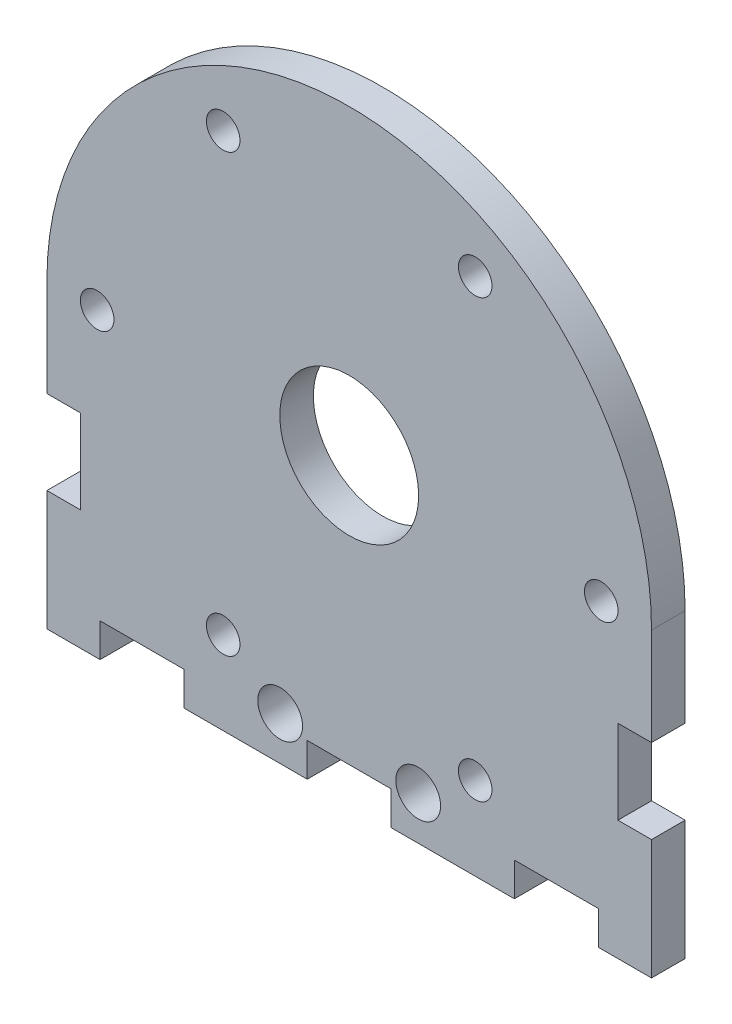
ISO-10303-21;
HEADER;
FILE_DESCRIPTION(('STEP AP214'),'2;1');
FILE_NAME('part.step','',(''),(''),'','','');
FILE_SCHEMA(('AUTOMOTIVE_DESIGN { 1 0 10303 214 1 1 1 1 }'));
ENDSEC;
DATA;
#1=APPLICATION_CONTEXT('core data for automotive mechanical design processes');
#2=APPLICATION_PROTOCOL_DEFINITION('international standard','automotive_design',2000,#1);
#3=PRODUCT_CONTEXT('',#1,'mechanical');
#4=PRODUCT('Part','Part','',(#3));
#5=PRODUCT_RELATED_PRODUCT_CATEGORY('part','',(#4));
#6=PRODUCT_DEFINITION_FORMATION('','',#4);
#7=PRODUCT_DEFINITION_CONTEXT('part definition',#1,'design');
#8=PRODUCT_DEFINITION('design','',#6,#7);
#9=PRODUCT_DEFINITION_SHAPE('','',#8);
#10=(LENGTH_UNIT() NAMED_UNIT(*) SI_UNIT(.MILLI.,.METRE.));
#11=(NAMED_UNIT(*) PLANE_ANGLE_UNIT() SI_UNIT($,.RADIAN.));
#12=(NAMED_UNIT(*) SI_UNIT($,.STERADIAN.) SOLID_ANGLE_UNIT());
#13=UNCERTAINTY_MEASURE_WITH_UNIT(LENGTH_MEASURE(1.E-05),#10,'distance_accuracy_value','');
#14=(GEOMETRIC_REPRESENTATION_CONTEXT(3) GLOBAL_UNCERTAINTY_ASSIGNED_CONTEXT((#13)) GLOBAL_UNIT_ASSIGNED_CONTEXT((#10,
#11,#12)) REPRESENTATION_CONTEXT('',''));
#15=CARTESIAN_POINT('',(0.,0.,0.));
#16=DIRECTION('',(0.,0.,1.));
#17=DIRECTION('',(1.,0.,0.));
#18=AXIS2_PLACEMENT_3D('',#15,#16,#17);
#19=CARTESIAN_POINT('',(2522.17425185726,0.,3.));
#20=DIRECTION('',(1.,0.,0.));
#21=DIRECTION('',(0.,0.,-1.));
#22=AXIS2_PLACEMENT_3D('',#19,#20,#21);
#23=PLANE('',#22);
#24=DIRECTION('',(0.,-1.,0.));
#25=VECTOR('',#24,1.);
#26=CARTESIAN_POINT('',(2522.17425185726,0.,0.));
#27=LINE('',#26,#25);
#28=CARTESIAN_POINT('',(2522.17425185726,1992.03397427987,0.));
#29=VERTEX_POINT('',#28);
#30=CARTESIAN_POINT('',(2522.17425185726,1983.32752149649,0.));
#31=VERTEX_POINT('',#30);
#32=EDGE_CURVE('E275',#29,#31,#27,.T.);
#33=ORIENTED_EDGE('',*,*,#32,.F.);
#34=DIRECTION('',(0.,0.,-1.));
#35=VECTOR('',#34,1.);
#36=CARTESIAN_POINT('',(2522.17425185726,1992.03397427987,3.));
#37=LINE('',#36,#35);
#38=CARTESIAN_POINT('',(2522.17425185726,1992.03397427987,3.));
#39=VERTEX_POINT('',#38);
#40=EDGE_CURVE('E11',#39,#29,#37,.T.);
#41=ORIENTED_EDGE('',*,*,#40,.F.);
#42=DIRECTION('',(0.,-1.,0.));
#43=VECTOR('',#42,1.);
#44=CARTESIAN_POINT('',(2522.17425185726,0.,3.));
#45=LINE('',#44,#43);
#46=CARTESIAN_POINT('',(2522.17425185726,1983.32752149649,3.));
#47=VERTEX_POINT('',#46);
#48=EDGE_CURVE('E986',#39,#47,#45,.T.);
#49=ORIENTED_EDGE('',*,*,#48,.T.);
#50=DIRECTION('',(0.,0.,-1.));
#51=VECTOR('',#50,1.);
#52=CARTESIAN_POINT('',(2522.17425185726,1983.32752149649,3.));
#53=LINE('',#52,#51);
#54=EDGE_CURVE('E61',#47,#31,#53,.T.);
#55=ORIENTED_EDGE('',*,*,#54,.T.);
#56=EDGE_LOOP('',(#33,#41,#49,#55));
#57=FACE_BOUND('',#56,.T.);
#58=ADVANCED_FACE('F43',(#57),#23,.T.);
#59=CARTESIAN_POINT('',(2495.17425185726,1992.03397427987,3.));
#60=DIRECTION('',(0.,0.,-1.));
#61=DIRECTION('',(-1.,0.,0.));
#62=AXIS2_PLACEMENT_3D('',#59,#60,#61);
#63=CYLINDRICAL_SURFACE('',#62,27.0000000000004);
#64=CARTESIAN_POINT('',(2495.17425185726,1992.03397427987,0.));
#65=DIRECTION('',(0.,0.,1.));
#66=DIRECTION('',(1.,0.,0.));
#67=AXIS2_PLACEMENT_3D('',#64,#65,#66);
#68=CIRCLE('',#67,27.0000000000004);
#69=CARTESIAN_POINT('',(2468.17425185726,1992.03397427987,0.));
#70=VERTEX_POINT('',#69);
#71=EDGE_CURVE('E278',#29,#70,#68,.T.);
#72=ORIENTED_EDGE('',*,*,#71,.T.);
#73=DIRECTION('',(0.,0.,-1.));
#74=VECTOR('',#73,1.);
#75=CARTESIAN_POINT('',(2468.17425185726,1992.03397427987,3.));
#76=LINE('',#75,#74);
#77=CARTESIAN_POINT('',(2468.17425185726,1992.03397427987,3.));
#78=VERTEX_POINT('',#77);
#79=EDGE_CURVE('E53',#78,#70,#76,.T.);
#80=ORIENTED_EDGE('',*,*,#79,.F.);
#81=CARTESIAN_POINT('',(2495.17425185726,1992.03397427987,3.));
#82=DIRECTION('',(0.,0.,1.));
#83=DIRECTION('',(1.,0.,0.));
#84=AXIS2_PLACEMENT_3D('',#81,#82,#83);
#85=CIRCLE('',#84,27.0000000000004);
#86=EDGE_CURVE('E901',#39,#78,#85,.T.);
#87=ORIENTED_EDGE('',*,*,#86,.F.);
#88=ORIENTED_EDGE('',*,*,#40,.T.);
#89=EDGE_LOOP('',(#72,#80,#87,#88));
#90=FACE_BOUND('',#89,.T.);
#91=ADVANCED_FACE('F448',(#90),#63,.T.);
#92=CARTESIAN_POINT('',(2468.17425185746,2.51787859086005E-10,3.));
#93=DIRECTION('',(1.,1.02013809963587E-13,0.));
#94=DIRECTION('',(-1.02013809963587E-13,1.,0.));
#95=AXIS2_PLACEMENT_3D('',#92,#93,#94);
#96=PLANE('',#95);
#97=DIRECTION('',(1.02013809963587E-13,-1.,0.));
#98=VECTOR('',#97,1.);
#99=CARTESIAN_POINT('',(2468.17425185746,2.51787859086005E-10,0.));
#100=LINE('',#99,#98);
#101=CARTESIAN_POINT('',(2468.17425185726,1983.32752149649,0.));
#102=VERTEX_POINT('',#101);
#103=EDGE_CURVE('E282',#70,#102,#100,.T.);
#104=ORIENTED_EDGE('',*,*,#103,.T.);
#105=DIRECTION('',(0.,0.,-1.));
#106=VECTOR('',#105,1.);
#107=CARTESIAN_POINT('',(2468.17425185726,1983.32752149649,3.));
#108=LINE('',#107,#106);
#109=CARTESIAN_POINT('',(2468.17425185726,1983.32752149649,3.));
#110=VERTEX_POINT('',#109);
#111=EDGE_CURVE('E434',#110,#102,#108,.T.);
#112=ORIENTED_EDGE('',*,*,#111,.F.);
#113=DIRECTION('',(1.02013809963587E-13,-1.,0.));
#114=VECTOR('',#113,1.);
#115=CARTESIAN_POINT('',(2468.17425185746,2.51787859086005E-10,3.));
#116=LINE('',#115,#114);
#117=EDGE_CURVE('E444',#78,#110,#116,.T.);
#118=ORIENTED_EDGE('',*,*,#117,.F.);
#119=ORIENTED_EDGE('',*,*,#79,.T.);
#120=EDGE_LOOP('',(#104,#112,#118,#119));
#121=FACE_BOUND('',#120,.T.);
#122=ADVANCED_FACE('F441',(#121),#96,.F.);
#123=CARTESIAN_POINT('',(0.,1983.32752149649,3.));
#124=DIRECTION('',(0.,1.,0.));
#125=DIRECTION('',(0.,0.,1.));
#126=AXIS2_PLACEMENT_3D('',#123,#124,#125);
#127=PLANE('',#126);
#128=DIRECTION('',(1.,0.,0.));
#129=VECTOR('',#128,1.);
#130=CARTESIAN_POINT('',(0.,1983.32752149649,0.));
#131=LINE('',#130,#129);
#132=CARTESIAN_POINT('',(2471.17425185726,1983.32752149649,0.));
#133=VERTEX_POINT('',#132);
#134=EDGE_CURVE('E286',#102,#133,#131,.T.);
#135=ORIENTED_EDGE('',*,*,#134,.T.);
#136=DIRECTION('',(0.,0.,-1.));
#137=VECTOR('',#136,1.);
#138=CARTESIAN_POINT('',(2471.17425185726,1983.32752149649,3.));
#139=LINE('',#138,#137);
#140=CARTESIAN_POINT('',(2471.17425185726,1983.32752149649,3.));
#141=VERTEX_POINT('',#140);
#142=EDGE_CURVE('E430',#141,#133,#139,.T.);
#143=ORIENTED_EDGE('',*,*,#142,.F.);
#144=DIRECTION('',(1.,0.,0.));
#145=VECTOR('',#144,1.);
#146=CARTESIAN_POINT('',(0.,1983.32752149649,3.));
#147=LINE('',#146,#145);
#148=EDGE_CURVE('E896',#110,#141,#147,.T.);
#149=ORIENTED_EDGE('',*,*,#148,.F.);
#150=ORIENTED_EDGE('',*,*,#111,.T.);
#151=EDGE_LOOP('',(#135,#143,#149,#150));
#152=FACE_BOUND('',#151,.T.);
#153=ADVANCED_FACE('F603',(#152),#127,.F.);
#154=CARTESIAN_POINT('',(2471.17425185726,0.,3.));
#155=DIRECTION('',(1.,0.,0.));
#156=DIRECTION('',(0.,0.,-1.));
#157=AXIS2_PLACEMENT_3D('',#154,#155,#156);
#158=PLANE('',#157);
#159=DIRECTION('',(0.,-1.,0.));
#160=VECTOR('',#159,1.);
#161=CARTESIAN_POINT('',(2471.17425185726,0.,0.));
#162=LINE('',#161,#160);
#163=CARTESIAN_POINT('',(2471.17425185726,1975.82752149649,0.));
#164=VERTEX_POINT('',#163);
#165=EDGE_CURVE('E290',#133,#164,#162,.T.);
#166=ORIENTED_EDGE('',*,*,#165,.T.);
#167=DIRECTION('',(0.,0.,-1.));
#168=VECTOR('',#167,1.);
#169=CARTESIAN_POINT('',(2471.17425185726,1975.82752149649,3.));
#170=LINE('',#169,#168);
#171=CARTESIAN_POINT('',(2471.17425185726,1975.82752149649,3.));
#172=VERTEX_POINT('',#171);
#173=EDGE_CURVE('E426',#172,#164,#170,.T.);
#174=ORIENTED_EDGE('',*,*,#173,.F.);
#175=DIRECTION('',(0.,-1.,0.));
#176=VECTOR('',#175,1.);
#177=CARTESIAN_POINT('',(2471.17425185726,0.,3.));
#178=LINE('',#177,#176);
#179=EDGE_CURVE('E891',#141,#172,#178,.T.);
#180=ORIENTED_EDGE('',*,*,#179,.F.);
#181=ORIENTED_EDGE('',*,*,#142,.T.);
#182=EDGE_LOOP('',(#166,#174,#180,#181));
#183=FACE_BOUND('',#182,.T.);
#184=ADVANCED_FACE('F599',(#183),#158,.F.);
#185=CARTESIAN_POINT('',(0.,1975.82752149649,3.));
#186=DIRECTION('',(0.,-1.,0.));
#187=DIRECTION('',(0.,0.,-1.));
#188=AXIS2_PLACEMENT_3D('',#185,#186,#187);
#189=PLANE('',#188);
#190=DIRECTION('',(-1.,0.,0.));
#191=VECTOR('',#190,1.);
#192=CARTESIAN_POINT('',(0.,1975.82752149649,0.));
#193=LINE('',#192,#191);
#194=CARTESIAN_POINT('',(2468.17425185726,1975.82752149649,0.));
#195=VERTEX_POINT('',#194);
#196=EDGE_CURVE('E294',#164,#195,#193,.T.);
#197=ORIENTED_EDGE('',*,*,#196,.T.);
#198=DIRECTION('',(0.,0.,-1.));
#199=VECTOR('',#198,1.);
#200=CARTESIAN_POINT('',(2468.17425185726,1975.82752149649,3.));
#201=LINE('',#200,#199);
#202=CARTESIAN_POINT('',(2468.17425185726,1975.82752149649,3.));
#203=VERTEX_POINT('',#202);
#204=EDGE_CURVE('E422',#203,#195,#201,.T.);
#205=ORIENTED_EDGE('',*,*,#204,.F.);
#206=DIRECTION('',(-1.,0.,0.));
#207=VECTOR('',#206,1.);
#208=CARTESIAN_POINT('',(0.,1975.82752149649,3.));
#209=LINE('',#208,#207);
#210=EDGE_CURVE('E895',#172,#203,#209,.T.);
#211=ORIENTED_EDGE('',*,*,#210,.F.);
#212=ORIENTED_EDGE('',*,*,#173,.T.);
#213=EDGE_LOOP('',(#197,#205,#211,#212));
#214=FACE_BOUND('',#213,.T.);
#215=ADVANCED_FACE('F595',(#214),#189,.F.);
#216=CARTESIAN_POINT('',(2468.17425185726,0.,3.));
#217=DIRECTION('',(1.,0.,0.));
#218=DIRECTION('',(0.,0.,-1.));
#219=AXIS2_PLACEMENT_3D('',#216,#217,#218);
#220=PLANE('',#219);
#221=DIRECTION('',(0.,-1.,0.));
#222=VECTOR('',#221,1.);
#223=CARTESIAN_POINT('',(2468.17425185726,0.,0.));
#224=LINE('',#223,#222);
#225=CARTESIAN_POINT('',(2468.17425185726,1965.12106871312,0.));
#226=VERTEX_POINT('',#225);
#227=EDGE_CURVE('E298',#195,#226,#224,.T.);
#228=ORIENTED_EDGE('',*,*,#227,.T.);
#229=DIRECTION('',(0.,0.,-1.));
#230=VECTOR('',#229,1.);
#231=CARTESIAN_POINT('',(2468.17425185726,1965.12106871312,3.));
#232=LINE('',#231,#230);
#233=CARTESIAN_POINT('',(2468.17425185726,1965.12106871312,3.));
#234=VERTEX_POINT('',#233);
#235=EDGE_CURVE('E418',#234,#226,#232,.T.);
#236=ORIENTED_EDGE('',*,*,#235,.F.);
#237=DIRECTION('',(0.,-1.,0.));
#238=VECTOR('',#237,1.);
#239=CARTESIAN_POINT('',(2468.17425185726,0.,3.));
#240=LINE('',#239,#238);
#241=EDGE_CURVE('E907',#203,#234,#240,.T.);
#242=ORIENTED_EDGE('',*,*,#241,.F.);
#243=ORIENTED_EDGE('',*,*,#204,.T.);
#244=EDGE_LOOP('',(#228,#236,#242,#243));
#245=FACE_BOUND('',#244,.T.);
#246=ADVANCED_FACE('F591',(#245),#220,.F.);
#247=CARTESIAN_POINT('',(-9.18620065962678E-11,1965.121068713,3.));
#248=DIRECTION('',(0.,1.,0.));
#249=DIRECTION('',(-1.,0.,0.));
#250=AXIS2_PLACEMENT_3D('',#247,#248,#249);
#251=PLANE('',#250);
#252=DIRECTION('',(1.,0.,0.));
#253=VECTOR('',#252,1.);
#254=CARTESIAN_POINT('',(-9.18620065962678E-11,1965.121068713,0.));
#255=LINE('',#254,#253);
#256=CARTESIAN_POINT('',(2472.92425185726,1965.12106871312,0.));
#257=VERTEX_POINT('',#256);
#258=EDGE_CURVE('E302',#226,#257,#255,.T.);
#259=ORIENTED_EDGE('',*,*,#258,.T.);
#260=DIRECTION('',(0.,0.,-1.));
#261=VECTOR('',#260,1.);
#262=CARTESIAN_POINT('',(2472.92425185726,1965.12106871312,3.));
#263=LINE('',#262,#261);
#264=CARTESIAN_POINT('',(2472.92425185726,1965.12106871312,3.));
#265=VERTEX_POINT('',#264);
#266=EDGE_CURVE('E414',#265,#257,#263,.T.);
#267=ORIENTED_EDGE('',*,*,#266,.F.);
#268=DIRECTION('',(1.,0.,0.));
#269=VECTOR('',#268,1.);
#270=CARTESIAN_POINT('',(-9.18620065962678E-11,1965.121068713,3.));
#271=LINE('',#270,#269);
#272=EDGE_CURVE('E911',#234,#265,#271,.T.);
#273=ORIENTED_EDGE('',*,*,#272,.F.);
#274=ORIENTED_EDGE('',*,*,#235,.T.);
#275=EDGE_LOOP('',(#259,#267,#273,#274));
#276=FACE_BOUND('',#275,.T.);
#277=ADVANCED_FACE('F587',(#276),#251,.F.);
#278=CARTESIAN_POINT('',(2472.92425185726,0.,3.));
#279=DIRECTION('',(-1.,0.,0.));
#280=DIRECTION('',(0.,0.,1.));
#281=AXIS2_PLACEMENT_3D('',#278,#279,#280);
#282=PLANE('',#281);
#283=DIRECTION('',(0.,1.,0.));
#284=VECTOR('',#283,1.);
#285=CARTESIAN_POINT('',(2472.92425185726,0.,0.));
#286=LINE('',#285,#284);
#287=CARTESIAN_POINT('',(2472.92425185726,1968.12106871312,0.));
#288=VERTEX_POINT('',#287);
#289=EDGE_CURVE('E306',#257,#288,#286,.T.);
#290=ORIENTED_EDGE('',*,*,#289,.T.);
#291=DIRECTION('',(0.,0.,-1.));
#292=VECTOR('',#291,1.);
#293=CARTESIAN_POINT('',(2472.92425185726,1968.12106871312,3.));
#294=LINE('',#293,#292);
#295=CARTESIAN_POINT('',(2472.92425185726,1968.12106871312,3.));
#296=VERTEX_POINT('',#295);
#297=EDGE_CURVE('E410',#296,#288,#294,.T.);
#298=ORIENTED_EDGE('',*,*,#297,.F.);
#299=DIRECTION('',(0.,1.,0.));
#300=VECTOR('',#299,1.);
#301=CARTESIAN_POINT('',(2472.92425185726,0.,3.));
#302=LINE('',#301,#300);
#303=EDGE_CURVE('E915',#265,#296,#302,.T.);
#304=ORIENTED_EDGE('',*,*,#303,.F.);
#305=ORIENTED_EDGE('',*,*,#266,.T.);
#306=EDGE_LOOP('',(#290,#298,#304,#305));
#307=FACE_BOUND('',#306,.T.);
#308=ADVANCED_FACE('F583',(#307),#282,.F.);
#309=CARTESIAN_POINT('',(0.,1968.12106871312,3.));
#310=DIRECTION('',(0.,1.,0.));
#311=DIRECTION('',(0.,0.,1.));
#312=AXIS2_PLACEMENT_3D('',#309,#310,#311);
#313=PLANE('',#312);
#314=DIRECTION('',(1.,0.,0.));
#315=VECTOR('',#314,1.);
#316=CARTESIAN_POINT('',(0.,1968.12106871312,0.));
#317=LINE('',#316,#315);
#318=CARTESIAN_POINT('',(2480.42425185726,1968.12106871312,0.));
#319=VERTEX_POINT('',#318);
#320=EDGE_CURVE('E310',#288,#319,#317,.T.);
#321=ORIENTED_EDGE('',*,*,#320,.T.);
#322=DIRECTION('',(0.,0.,-1.));
#323=VECTOR('',#322,1.);
#324=CARTESIAN_POINT('',(2480.42425185726,1968.12106871312,3.));
#325=LINE('',#324,#323);
#326=CARTESIAN_POINT('',(2480.42425185726,1968.12106871312,3.));
#327=VERTEX_POINT('',#326);
#328=EDGE_CURVE('E406',#327,#319,#325,.T.);
#329=ORIENTED_EDGE('',*,*,#328,.F.);
#330=DIRECTION('',(1.,0.,0.));
#331=VECTOR('',#330,1.);
#332=CARTESIAN_POINT('',(0.,1968.12106871312,3.));
#333=LINE('',#332,#331);
#334=EDGE_CURVE('E919',#296,#327,#333,.T.);
#335=ORIENTED_EDGE('',*,*,#334,.F.);
#336=ORIENTED_EDGE('',*,*,#297,.T.);
#337=EDGE_LOOP('',(#321,#329,#335,#336));
#338=FACE_BOUND('',#337,.T.);
#339=ADVANCED_FACE('F579',(#338),#313,.F.);
#340=CARTESIAN_POINT('',(2480.42425185726,0.,3.));
#341=DIRECTION('',(1.,0.,0.));
#342=DIRECTION('',(0.,0.,-1.));
#343=AXIS2_PLACEMENT_3D('',#340,#341,#342);
#344=PLANE('',#343);
#345=DIRECTION('',(0.,-1.,0.));
#346=VECTOR('',#345,1.);
#347=CARTESIAN_POINT('',(2480.42425185726,0.,0.));
#348=LINE('',#347,#346);
#349=CARTESIAN_POINT('',(2480.42425185726,1965.12106871312,0.));
#350=VERTEX_POINT('',#349);
#351=EDGE_CURVE('E314',#319,#350,#348,.T.);
#352=ORIENTED_EDGE('',*,*,#351,.T.);
#353=DIRECTION('',(0.,0.,-1.));
#354=VECTOR('',#353,1.);
#355=CARTESIAN_POINT('',(2480.42425185726,1965.12106871312,3.));
#356=LINE('',#355,#354);
#357=CARTESIAN_POINT('',(2480.42425185726,1965.12106871312,3.));
#358=VERTEX_POINT('',#357);
#359=EDGE_CURVE('E403',#358,#350,#356,.T.);
#360=ORIENTED_EDGE('',*,*,#359,.F.);
#361=DIRECTION('',(0.,-1.,0.));
#362=VECTOR('',#361,1.);
#363=CARTESIAN_POINT('',(2480.42425185726,0.,3.));
#364=LINE('',#363,#362);
#365=EDGE_CURVE('E923',#327,#358,#364,.T.);
#366=ORIENTED_EDGE('',*,*,#365,.F.);
#367=ORIENTED_EDGE('',*,*,#328,.T.);
#368=EDGE_LOOP('',(#352,#360,#366,#367));
#369=FACE_BOUND('',#368,.T.);
#370=ADVANCED_FACE('F575',(#369),#344,.F.);
#371=CARTESIAN_POINT('',(0.,1965.12106871312,3.));
#372=DIRECTION('',(0.,-1.,0.));
#373=DIRECTION('',(0.,0.,-1.));
#374=AXIS2_PLACEMENT_3D('',#371,#372,#373);
#375=PLANE('',#374);
#376=DIRECTION('',(-1.,0.,0.));
#377=VECTOR('',#376,1.);
#378=CARTESIAN_POINT('',(0.,1965.12106871312,0.));
#379=LINE('',#378,#377);
#380=CARTESIAN_POINT('',(2491.42425185726,1965.12106871312,0.));
#381=VERTEX_POINT('',#380);
#382=EDGE_CURVE('E318',#381,#350,#379,.T.);
#383=ORIENTED_EDGE('',*,*,#382,.F.);
#384=DIRECTION('',(0.,0.,-1.));
#385=VECTOR('',#384,1.);
#386=CARTESIAN_POINT('',(2491.42425185726,1965.12106871312,3.));
#387=LINE('',#386,#385);
#388=CARTESIAN_POINT('',(2491.42425185726,1965.12106871312,3.));
#389=VERTEX_POINT('',#388);
#390=EDGE_CURVE('E400',#389,#381,#387,.T.);
#391=ORIENTED_EDGE('',*,*,#390,.F.);
#392=DIRECTION('',(-1.,0.,0.));
#393=VECTOR('',#392,1.);
#394=CARTESIAN_POINT('',(0.,1965.12106871312,3.));
#395=LINE('',#394,#393);
#396=EDGE_CURVE('E926',#389,#358,#395,.T.);
#397=ORIENTED_EDGE('',*,*,#396,.T.);
#398=ORIENTED_EDGE('',*,*,#359,.T.);
#399=EDGE_LOOP('',(#383,#391,#397,#398));
#400=FACE_BOUND('',#399,.T.);
#401=ADVANCED_FACE('F571',(#400),#375,.T.);
#402=CARTESIAN_POINT('',(2491.42425185726,0.,3.));
#403=DIRECTION('',(-1.,0.,0.));
#404=DIRECTION('',(0.,0.,1.));
#405=AXIS2_PLACEMENT_3D('',#402,#403,#404);
#406=PLANE('',#405);
#407=DIRECTION('',(0.,1.,0.));
#408=VECTOR('',#407,1.);
#409=CARTESIAN_POINT('',(2491.42425185726,0.,0.));
#410=LINE('',#409,#408);
#411=CARTESIAN_POINT('',(2491.42425185726,1968.12106871312,0.));
#412=VERTEX_POINT('',#411);
#413=EDGE_CURVE('E322',#381,#412,#410,.T.);
#414=ORIENTED_EDGE('',*,*,#413,.T.);
#415=DIRECTION('',(0.,0.,-1.));
#416=VECTOR('',#415,1.);
#417=CARTESIAN_POINT('',(2491.42425185726,1968.12106871312,3.));
#418=LINE('',#417,#416);
#419=CARTESIAN_POINT('',(2491.42425185726,1968.12106871312,3.));
#420=VERTEX_POINT('',#419);
#421=EDGE_CURVE('E396',#420,#412,#418,.T.);
#422=ORIENTED_EDGE('',*,*,#421,.F.);
#423=DIRECTION('',(0.,1.,0.));
#424=VECTOR('',#423,1.);
#425=CARTESIAN_POINT('',(2491.42425185726,0.,3.));
#426=LINE('',#425,#424);
#427=EDGE_CURVE('E930',#389,#420,#426,.T.);
#428=ORIENTED_EDGE('',*,*,#427,.F.);
#429=ORIENTED_EDGE('',*,*,#390,.T.);
#430=EDGE_LOOP('',(#414,#422,#428,#429));
#431=FACE_BOUND('',#430,.T.);
#432=ADVANCED_FACE('F567',(#431),#406,.F.);
#433=CARTESIAN_POINT('',(0.,1968.12106871312,3.));
#434=DIRECTION('',(0.,1.,0.));
#435=DIRECTION('',(0.,0.,1.));
#436=AXIS2_PLACEMENT_3D('',#433,#434,#435);
#437=PLANE('',#436);
#438=DIRECTION('',(1.,0.,0.));
#439=VECTOR('',#438,1.);
#440=CARTESIAN_POINT('',(0.,1968.12106871312,0.));
#441=LINE('',#440,#439);
#442=CARTESIAN_POINT('',(2498.92425185726,1968.12106871312,0.));
#443=VERTEX_POINT('',#442);
#444=EDGE_CURVE('E326',#412,#443,#441,.T.);
#445=ORIENTED_EDGE('',*,*,#444,.T.);
#446=DIRECTION('',(0.,0.,-1.));
#447=VECTOR('',#446,1.);
#448=CARTESIAN_POINT('',(2498.92425185726,1968.12106871312,3.));
#449=LINE('',#448,#447);
#450=CARTESIAN_POINT('',(2498.92425185726,1968.12106871312,3.));
#451=VERTEX_POINT('',#450);
#452=EDGE_CURVE('E392',#451,#443,#449,.T.);
#453=ORIENTED_EDGE('',*,*,#452,.F.);
#454=DIRECTION('',(1.,0.,0.));
#455=VECTOR('',#454,1.);
#456=CARTESIAN_POINT('',(0.,1968.12106871312,3.));
#457=LINE('',#456,#455);
#458=EDGE_CURVE('E934',#420,#451,#457,.T.);
#459=ORIENTED_EDGE('',*,*,#458,.F.);
#460=ORIENTED_EDGE('',*,*,#421,.T.);
#461=EDGE_LOOP('',(#445,#453,#459,#460));
#462=FACE_BOUND('',#461,.T.);
#463=ADVANCED_FACE('F563',(#462),#437,.F.);
#464=CARTESIAN_POINT('',(2498.92425185726,0.,3.));
#465=DIRECTION('',(1.,0.,0.));
#466=DIRECTION('',(0.,0.,-1.));
#467=AXIS2_PLACEMENT_3D('',#464,#465,#466);
#468=PLANE('',#467);
#469=DIRECTION('',(0.,-1.,0.));
#470=VECTOR('',#469,1.);
#471=CARTESIAN_POINT('',(2498.92425185726,0.,0.));
#472=LINE('',#471,#470);
#473=CARTESIAN_POINT('',(2498.92425185726,1965.12106871312,0.));
#474=VERTEX_POINT('',#473);
#475=EDGE_CURVE('E330',#443,#474,#472,.T.);
#476=ORIENTED_EDGE('',*,*,#475,.T.);
#477=DIRECTION('',(0.,0.,-1.));
#478=VECTOR('',#477,1.);
#479=CARTESIAN_POINT('',(2498.92425185726,1965.12106871312,3.));
#480=LINE('',#479,#478);
#481=CARTESIAN_POINT('',(2498.92425185726,1965.12106871312,3.));
#482=VERTEX_POINT('',#481);
#483=EDGE_CURVE('E389',#482,#474,#480,.T.);
#484=ORIENTED_EDGE('',*,*,#483,.F.);
#485=DIRECTION('',(0.,-1.,0.));
#486=VECTOR('',#485,1.);
#487=CARTESIAN_POINT('',(2498.92425185726,0.,3.));
#488=LINE('',#487,#486);
#489=EDGE_CURVE('E938',#451,#482,#488,.T.);
#490=ORIENTED_EDGE('',*,*,#489,.F.);
#491=ORIENTED_EDGE('',*,*,#452,.T.);
#492=EDGE_LOOP('',(#476,#484,#490,#491));
#493=FACE_BOUND('',#492,.T.);
#494=ADVANCED_FACE('F559',(#493),#468,.F.);
#495=CARTESIAN_POINT('',(0.,1965.12106871312,3.));
#496=DIRECTION('',(0.,-1.,0.));
#497=DIRECTION('',(0.,0.,-1.));
#498=AXIS2_PLACEMENT_3D('',#495,#496,#497);
#499=PLANE('',#498);
#500=DIRECTION('',(-1.,0.,0.));
#501=VECTOR('',#500,1.);
#502=CARTESIAN_POINT('',(0.,1965.12106871312,0.));
#503=LINE('',#502,#501);
#504=CARTESIAN_POINT('',(2509.92425185726,1965.12106871312,0.));
#505=VERTEX_POINT('',#504);
#506=EDGE_CURVE('E334',#505,#474,#503,.T.);
#507=ORIENTED_EDGE('',*,*,#506,.F.);
#508=DIRECTION('',(0.,0.,-1.));
#509=VECTOR('',#508,1.);
#510=CARTESIAN_POINT('',(2509.92425185726,1965.12106871312,3.));
#511=LINE('',#510,#509);
#512=CARTESIAN_POINT('',(2509.92425185726,1965.12106871312,3.));
#513=VERTEX_POINT('',#512);
#514=EDGE_CURVE('E386',#513,#505,#511,.T.);
#515=ORIENTED_EDGE('',*,*,#514,.F.);
#516=DIRECTION('',(-1.,0.,0.));
#517=VECTOR('',#516,1.);
#518=CARTESIAN_POINT('',(0.,1965.12106871312,3.));
#519=LINE('',#518,#517);
#520=EDGE_CURVE('E941',#513,#482,#519,.T.);
#521=ORIENTED_EDGE('',*,*,#520,.T.);
#522=ORIENTED_EDGE('',*,*,#483,.T.);
#523=EDGE_LOOP('',(#507,#515,#521,#522));
#524=FACE_BOUND('',#523,.T.);
#525=ADVANCED_FACE('F555',(#524),#499,.T.);
#526=CARTESIAN_POINT('',(2509.92425185726,0.,3.));
#527=DIRECTION('',(1.,0.,0.));
#528=DIRECTION('',(0.,0.,-1.));
#529=AXIS2_PLACEMENT_3D('',#526,#527,#528);
#530=PLANE('',#529);
#531=DIRECTION('',(0.,-1.,0.));
#532=VECTOR('',#531,1.);
#533=CARTESIAN_POINT('',(2509.92425185726,0.,0.));
#534=LINE('',#533,#532);
#535=CARTESIAN_POINT('',(2509.92425185726,1968.12106871312,0.));
#536=VERTEX_POINT('',#535);
#537=EDGE_CURVE('E338',#536,#505,#534,.T.);
#538=ORIENTED_EDGE('',*,*,#537,.F.);
#539=DIRECTION('',(0.,0.,-1.));
#540=VECTOR('',#539,1.);
#541=CARTESIAN_POINT('',(2509.92425185726,1968.12106871312,3.));
#542=LINE('',#541,#540);
#543=CARTESIAN_POINT('',(2509.92425185726,1968.12106871312,3.));
#544=VERTEX_POINT('',#543);
#545=EDGE_CURVE('E383',#544,#536,#542,.T.);
#546=ORIENTED_EDGE('',*,*,#545,.F.);
#547=DIRECTION('',(0.,-1.,0.));
#548=VECTOR('',#547,1.);
#549=CARTESIAN_POINT('',(2509.92425185726,0.,3.));
#550=LINE('',#549,#548);
#551=EDGE_CURVE('E945',#544,#513,#550,.T.);
#552=ORIENTED_EDGE('',*,*,#551,.T.);
#553=ORIENTED_EDGE('',*,*,#514,.T.);
#554=EDGE_LOOP('',(#538,#546,#552,#553));
#555=FACE_BOUND('',#554,.T.);
#556=ADVANCED_FACE('F551',(#555),#530,.T.);
#557=CARTESIAN_POINT('',(0.,1968.12106871312,3.));
#558=DIRECTION('',(0.,-1.,0.));
#559=DIRECTION('',(0.,0.,-1.));
#560=AXIS2_PLACEMENT_3D('',#557,#558,#559);
#561=PLANE('',#560);
#562=DIRECTION('',(-1.,0.,0.));
#563=VECTOR('',#562,1.);
#564=CARTESIAN_POINT('',(0.,1968.12106871312,0.));
#565=LINE('',#564,#563);
#566=CARTESIAN_POINT('',(2517.42425185726,1968.12106871312,0.));
#567=VERTEX_POINT('',#566);
#568=EDGE_CURVE('E342',#567,#536,#565,.T.);
#569=ORIENTED_EDGE('',*,*,#568,.F.);
#570=DIRECTION('',(0.,0.,-1.));
#571=VECTOR('',#570,1.);
#572=CARTESIAN_POINT('',(2517.42425185726,1968.12106871312,3.));
#573=LINE('',#572,#571);
#574=CARTESIAN_POINT('',(2517.42425185726,1968.12106871312,3.));
#575=VERTEX_POINT('',#574);
#576=EDGE_CURVE('E380',#575,#567,#573,.T.);
#577=ORIENTED_EDGE('',*,*,#576,.F.);
#578=DIRECTION('',(-1.,0.,0.));
#579=VECTOR('',#578,1.);
#580=CARTESIAN_POINT('',(0.,1968.12106871312,3.));
#581=LINE('',#580,#579);
#582=EDGE_CURVE('E949',#575,#544,#581,.T.);
#583=ORIENTED_EDGE('',*,*,#582,.T.);
#584=ORIENTED_EDGE('',*,*,#545,.T.);
#585=EDGE_LOOP('',(#569,#577,#583,#584));
#586=FACE_BOUND('',#585,.T.);
#587=ADVANCED_FACE('F547',(#586),#561,.T.);
#588=CARTESIAN_POINT('',(2517.42425185726,0.,3.));
#589=DIRECTION('',(-1.,0.,0.));
#590=DIRECTION('',(0.,0.,1.));
#591=AXIS2_PLACEMENT_3D('',#588,#589,#590);
#592=PLANE('',#591);
#593=DIRECTION('',(0.,1.,0.));
#594=VECTOR('',#593,1.);
#595=CARTESIAN_POINT('',(2517.42425185726,0.,0.));
#596=LINE('',#595,#594);
#597=CARTESIAN_POINT('',(2517.42425185726,1965.12106871312,0.));
#598=VERTEX_POINT('',#597);
#599=EDGE_CURVE('E346',#598,#567,#596,.T.);
#600=ORIENTED_EDGE('',*,*,#599,.F.);
#601=DIRECTION('',(0.,0.,-1.));
#602=VECTOR('',#601,1.);
#603=CARTESIAN_POINT('',(2517.42425185726,1965.12106871312,3.));
#604=LINE('',#603,#602);
#605=CARTESIAN_POINT('',(2517.42425185726,1965.12106871312,3.));
#606=VERTEX_POINT('',#605);
#607=EDGE_CURVE('E377',#606,#598,#604,.T.);
#608=ORIENTED_EDGE('',*,*,#607,.F.);
#609=DIRECTION('',(0.,1.,0.));
#610=VECTOR('',#609,1.);
#611=CARTESIAN_POINT('',(2517.42425185726,0.,3.));
#612=LINE('',#611,#610);
#613=EDGE_CURVE('E953',#606,#575,#612,.T.);
#614=ORIENTED_EDGE('',*,*,#613,.T.);
#615=ORIENTED_EDGE('',*,*,#576,.T.);
#616=EDGE_LOOP('',(#600,#608,#614,#615));
#617=FACE_BOUND('',#616,.T.);
#618=ADVANCED_FACE('F543',(#617),#592,.T.);
#619=CARTESIAN_POINT('',(9.18620065962787E-11,1965.12106871324,3.));
#620=DIRECTION('',(0.,-1.,0.));
#621=DIRECTION('',(1.,0.,0.));
#622=AXIS2_PLACEMENT_3D('',#619,#620,#621);
#623=PLANE('',#622);
#624=DIRECTION('',(-1.,0.,0.));
#625=VECTOR('',#624,1.);
#626=CARTESIAN_POINT('',(9.18620065962787E-11,1965.12106871324,0.));
#627=LINE('',#626,#625);
#628=CARTESIAN_POINT('',(2522.17425185726,1965.12106871312,0.));
#629=VERTEX_POINT('',#628);
#630=EDGE_CURVE('E350',#629,#598,#627,.T.);
#631=ORIENTED_EDGE('',*,*,#630,.F.);
#632=DIRECTION('',(0.,0.,-1.));
#633=VECTOR('',#632,1.);
#634=CARTESIAN_POINT('',(2522.17425185726,1965.12106871312,3.));
#635=LINE('',#634,#633);
#636=CARTESIAN_POINT('',(2522.17425185726,1965.12106871312,3.));
#637=VERTEX_POINT('',#636);
#638=EDGE_CURVE('E374',#637,#629,#635,.T.);
#639=ORIENTED_EDGE('',*,*,#638,.F.);
#640=DIRECTION('',(-1.,0.,0.));
#641=VECTOR('',#640,1.);
#642=CARTESIAN_POINT('',(9.18620065962787E-11,1965.12106871324,3.));
#643=LINE('',#642,#641);
#644=EDGE_CURVE('E957',#637,#606,#643,.T.);
#645=ORIENTED_EDGE('',*,*,#644,.T.);
#646=ORIENTED_EDGE('',*,*,#607,.T.);
#647=EDGE_LOOP('',(#631,#639,#645,#646));
#648=FACE_BOUND('',#647,.T.);
#649=ADVANCED_FACE('F539',(#648),#623,.T.);
#650=CARTESIAN_POINT('',(2522.17425185726,0.,3.));
#651=DIRECTION('',(1.,0.,0.));
#652=DIRECTION('',(0.,0.,-1.));
#653=AXIS2_PLACEMENT_3D('',#650,#651,#652);
#654=PLANE('',#653);
#655=DIRECTION('',(0.,-1.,0.));
#656=VECTOR('',#655,1.);
#657=CARTESIAN_POINT('',(2522.17425185726,0.,0.));
#658=LINE('',#657,#656);
#659=CARTESIAN_POINT('',(2522.17425185726,1975.82752149649,0.));
#660=VERTEX_POINT('',#659);
#661=EDGE_CURVE('E354',#660,#629,#658,.T.);
#662=ORIENTED_EDGE('',*,*,#661,.F.);
#663=DIRECTION('',(0.,0.,-1.));
#664=VECTOR('',#663,1.);
#665=CARTESIAN_POINT('',(2522.17425185726,1975.82752149649,3.));
#666=LINE('',#665,#664);
#667=CARTESIAN_POINT('',(2522.17425185726,1975.82752149649,3.));
#668=VERTEX_POINT('',#667);
#669=EDGE_CURVE('E217',#668,#660,#666,.T.);
#670=ORIENTED_EDGE('',*,*,#669,.F.);
#671=DIRECTION('',(0.,-1.,0.));
#672=VECTOR('',#671,1.);
#673=CARTESIAN_POINT('',(2522.17425185726,0.,3.));
#674=LINE('',#673,#672);
#675=EDGE_CURVE('E228',#668,#637,#674,.T.);
#676=ORIENTED_EDGE('',*,*,#675,.T.);
#677=ORIENTED_EDGE('',*,*,#638,.T.);
#678=EDGE_LOOP('',(#662,#670,#676,#677));
#679=FACE_BOUND('',#678,.T.);
#680=ADVANCED_FACE('F536',(#679),#654,.T.);
#681=CARTESIAN_POINT('',(0.,1975.82752149649,3.));
#682=DIRECTION('',(0.,1.,0.));
#683=DIRECTION('',(0.,0.,1.));
#684=AXIS2_PLACEMENT_3D('',#681,#682,#683);
#685=PLANE('',#684);
#686=DIRECTION('',(1.,0.,0.));
#687=VECTOR('',#686,1.);
#688=CARTESIAN_POINT('',(0.,1975.82752149649,0.));
#689=LINE('',#688,#687);
#690=CARTESIAN_POINT('',(2519.17425185726,1975.82752149649,0.));
#691=VERTEX_POINT('',#690);
#692=EDGE_CURVE('E212',#691,#660,#689,.T.);
#693=ORIENTED_EDGE('',*,*,#692,.F.);
#694=DIRECTION('',(0.,0.,-1.));
#695=VECTOR('',#694,1.);
#696=CARTESIAN_POINT('',(2519.17425185726,1975.82752149649,3.));
#697=LINE('',#696,#695);
#698=CARTESIAN_POINT('',(2519.17425185726,1975.82752149649,3.));
#699=VERTEX_POINT('',#698);
#700=EDGE_CURVE('E207',#699,#691,#697,.T.);
#701=ORIENTED_EDGE('',*,*,#700,.F.);
#702=DIRECTION('',(1.,0.,0.));
#703=VECTOR('',#702,1.);
#704=CARTESIAN_POINT('',(0.,1975.82752149649,3.));
#705=LINE('',#704,#703);
#706=EDGE_CURVE('E210',#699,#668,#705,.T.);
#707=ORIENTED_EDGE('',*,*,#706,.T.);
#708=ORIENTED_EDGE('',*,*,#669,.T.);
#709=EDGE_LOOP('',(#693,#701,#707,#708));
#710=FACE_BOUND('',#709,.T.);
#711=ADVANCED_FACE('F209',(#710),#685,.T.);
#712=CARTESIAN_POINT('',(2519.17425185726,0.,3.));
#713=DIRECTION('',(1.,0.,0.));
#714=DIRECTION('',(0.,0.,-1.));
#715=AXIS2_PLACEMENT_3D('',#712,#713,#714);
#716=PLANE('',#715);
#717=DIRECTION('',(0.,-1.,0.));
#718=VECTOR('',#717,1.);
#719=CARTESIAN_POINT('',(2519.17425185726,0.,0.));
#720=LINE('',#719,#718);
#721=CARTESIAN_POINT('',(2519.17425185726,1983.32752149649,0.));
#722=VERTEX_POINT('',#721);
#723=EDGE_CURVE('E360',#722,#691,#720,.T.);
#724=ORIENTED_EDGE('',*,*,#723,.F.);
#725=DIRECTION('',(0.,0.,-1.));
#726=VECTOR('',#725,1.);
#727=CARTESIAN_POINT('',(2519.17425185726,1983.32752149649,3.));
#728=LINE('',#727,#726);
#729=CARTESIAN_POINT('',(2519.17425185726,1983.32752149649,3.));
#730=VERTEX_POINT('',#729);
#731=EDGE_CURVE('E134',#730,#722,#728,.T.);
#732=ORIENTED_EDGE('',*,*,#731,.F.);
#733=DIRECTION('',(0.,-1.,0.));
#734=VECTOR('',#733,1.);
#735=CARTESIAN_POINT('',(2519.17425185726,0.,3.));
#736=LINE('',#735,#734);
#737=EDGE_CURVE('E225',#730,#699,#736,.T.);
#738=ORIENTED_EDGE('',*,*,#737,.T.);
#739=ORIENTED_EDGE('',*,*,#700,.T.);
#740=EDGE_LOOP('',(#724,#732,#738,#739));
#741=FACE_BOUND('',#740,.T.);
#742=ADVANCED_FACE('F231',(#741),#716,.T.);
#743=CARTESIAN_POINT('',(2495.17425185726,1992.03397427987,3.));
#744=DIRECTION('',(0.,0.,-1.));
#745=DIRECTION('',(-1.,0.,0.));
#746=AXIS2_PLACEMENT_3D('',#743,#744,#745);
#747=CYLINDRICAL_SURFACE('',#746,6.20000000000021);
#748=CARTESIAN_POINT('',(2495.17425185726,1992.03397427987,3.));
#749=DIRECTION('',(0.,0.,1.));
#750=DIRECTION('',(1.,0.,0.));
#751=AXIS2_PLACEMENT_3D('',#748,#749,#750);
#752=CIRCLE('',#751,6.20000000000021);
#753=CARTESIAN_POINT('',(2501.37425185726,1992.03397427987,3.));
#754=VERTEX_POINT('',#753);
#755=EDGE_CURVE('E989',#754,#754,#752,.T.);
#756=ORIENTED_EDGE('',*,*,#755,.T.);
#757=EDGE_LOOP('',(#756));
#758=FACE_BOUND('',#757,.T.);
#759=CARTESIAN_POINT('',(2495.17425185726,1992.03397427987,0.));
#760=DIRECTION('',(0.,0.,1.));
#761=DIRECTION('',(1.,0.,0.));
#762=AXIS2_PLACEMENT_3D('',#759,#760,#761);
#763=CIRCLE('',#762,6.20000000000021);
#764=CARTESIAN_POINT('',(2501.37425185726,1992.03397427987,0.));
#765=VERTEX_POINT('',#764);
#766=EDGE_CURVE('E271',#765,#765,#763,.T.);
#767=ORIENTED_EDGE('',*,*,#766,.F.);
#768=EDGE_LOOP('',(#767));
#769=FACE_BOUND('',#768,.T.);
#770=ADVANCED_FACE('F459',(#758,#769),#747,.F.);
#771=CARTESIAN_POINT('',(2489.0104492861,1969.0074785998,3.));
#772=DIRECTION('',(0.,0.,-1.));
#773=DIRECTION('',(-1.,0.,0.));
#774=AXIS2_PLACEMENT_3D('',#771,#772,#773);
#775=CYLINDRICAL_SURFACE('',#774,1.99999999999978);
#776=CARTESIAN_POINT('',(2489.0104492861,1969.0074785998,3.));
#777=DIRECTION('',(0.,0.,1.));
#778=DIRECTION('',(1.,0.,0.));
#779=AXIS2_PLACEMENT_3D('',#776,#777,#778);
#780=CIRCLE('',#779,1.99999999999978);
#781=CARTESIAN_POINT('',(2491.0104492861,1969.0074785998,3.));
#782=VERTEX_POINT('',#781);
#783=EDGE_CURVE('E993',#782,#782,#780,.T.);
#784=ORIENTED_EDGE('',*,*,#783,.T.);
#785=EDGE_LOOP('',(#784));
#786=FACE_BOUND('',#785,.T.);
#787=CARTESIAN_POINT('',(2489.0104492861,1969.0074785998,0.));
#788=DIRECTION('',(0.,0.,1.));
#789=DIRECTION('',(1.,0.,0.));
#790=AXIS2_PLACEMENT_3D('',#787,#788,#789);
#791=CIRCLE('',#790,1.99999999999978);
#792=CARTESIAN_POINT('',(2491.0104492861,1969.0074785998,0.));
#793=VERTEX_POINT('',#792);
#794=EDGE_CURVE('E267',#793,#793,#791,.T.);
#795=ORIENTED_EDGE('',*,*,#794,.F.);
#796=EDGE_LOOP('',(#795));
#797=FACE_BOUND('',#796,.T.);
#798=ADVANCED_FACE('F462',(#786,#797),#775,.F.);
#799=CARTESIAN_POINT('',(2506.42943324265,1972.53942827196,3.));
#800=DIRECTION('',(0.,0.,-1.));
#801=DIRECTION('',(-1.,0.,0.));
#802=AXIS2_PLACEMENT_3D('',#799,#800,#801);
#803=CYLINDRICAL_SURFACE('',#802,1.50000000000006);
#804=CARTESIAN_POINT('',(2506.42943324265,1972.53942827196,3.));
#805=DIRECTION('',(0.,0.,1.));
#806=DIRECTION('',(1.,0.,0.));
#807=AXIS2_PLACEMENT_3D('',#804,#805,#806);
#808=CIRCLE('',#807,1.50000000000006);
#809=CARTESIAN_POINT('',(2507.92943324265,1972.53942827196,3.));
#810=VERTEX_POINT('',#809);
#811=EDGE_CURVE('E997',#810,#810,#808,.T.);
#812=ORIENTED_EDGE('',*,*,#811,.T.);
#813=EDGE_LOOP('',(#812));
#814=FACE_BOUND('',#813,.T.);
#815=CARTESIAN_POINT('',(2506.42943324265,1972.53942827196,0.));
#816=DIRECTION('',(0.,0.,1.));
#817=DIRECTION('',(1.,0.,0.));
#818=AXIS2_PLACEMENT_3D('',#815,#816,#817);
#819=CIRCLE('',#818,1.50000000000006);
#820=CARTESIAN_POINT('',(2507.92943324265,1972.53942827196,0.));
#821=VERTEX_POINT('',#820);
#822=EDGE_CURVE('E263',#821,#821,#819,.T.);
#823=ORIENTED_EDGE('',*,*,#822,.F.);
#824=EDGE_LOOP('',(#823));
#825=FACE_BOUND('',#824,.T.);
#826=ADVANCED_FACE('F466',(#814,#825),#803,.F.);
#827=CARTESIAN_POINT('',(2483.91907047187,1972.53942827196,3.));
#828=DIRECTION('',(0.,0.,-1.));
#829=DIRECTION('',(-1.,0.,0.));
#830=AXIS2_PLACEMENT_3D('',#827,#828,#829);
#831=CYLINDRICAL_SURFACE('',#830,1.50000000000006);
#832=CARTESIAN_POINT('',(2483.91907047187,1972.53942827196,3.));
#833=DIRECTION('',(0.,0.,1.));
#834=DIRECTION('',(1.,0.,0.));
#835=AXIS2_PLACEMENT_3D('',#832,#833,#834);
#836=CIRCLE('',#835,1.50000000000006);
#837=CARTESIAN_POINT('',(2485.41907047187,1972.53942827196,3.));
#838=VERTEX_POINT('',#837);
#839=EDGE_CURVE('E1001',#838,#838,#836,.T.);
#840=ORIENTED_EDGE('',*,*,#839,.T.);
#841=EDGE_LOOP('',(#840));
#842=FACE_BOUND('',#841,.T.);
#843=CARTESIAN_POINT('',(2483.91907047187,1972.53942827196,0.));
#844=DIRECTION('',(0.,0.,1.));
#845=DIRECTION('',(1.,0.,0.));
#846=AXIS2_PLACEMENT_3D('',#843,#844,#845);
#847=CIRCLE('',#846,1.50000000000006);
#848=CARTESIAN_POINT('',(2485.41907047187,1972.53942827196,0.));
#849=VERTEX_POINT('',#848);
#850=EDGE_CURVE('E259',#849,#849,#847,.T.);
#851=ORIENTED_EDGE('',*,*,#850,.F.);
#852=EDGE_LOOP('',(#851));
#853=FACE_BOUND('',#852,.T.);
#854=ADVANCED_FACE('F470',(#842,#853),#831,.F.);
#855=CARTESIAN_POINT('',(2501.33805442842,1969.0074785998,3.));
#856=DIRECTION('',(0.,0.,-1.));
#857=DIRECTION('',(-1.,0.,0.));
#858=AXIS2_PLACEMENT_3D('',#855,#856,#857);
#859=CYLINDRICAL_SURFACE('',#858,1.99999999999978);
#860=CARTESIAN_POINT('',(2501.33805442842,1969.0074785998,3.));
#861=DIRECTION('',(0.,0.,1.));
#862=DIRECTION('',(1.,0.,0.));
#863=AXIS2_PLACEMENT_3D('',#860,#861,#862);
#864=CIRCLE('',#863,1.99999999999978);
#865=CARTESIAN_POINT('',(2503.33805442842,1969.0074785998,3.));
#866=VERTEX_POINT('',#865);
#867=EDGE_CURVE('E1005',#866,#866,#864,.T.);
#868=ORIENTED_EDGE('',*,*,#867,.T.);
#869=EDGE_LOOP('',(#868));
#870=FACE_BOUND('',#869,.T.);
#871=CARTESIAN_POINT('',(2501.33805442842,1969.0074785998,0.));
#872=DIRECTION('',(0.,0.,1.));
#873=DIRECTION('',(1.,0.,0.));
#874=AXIS2_PLACEMENT_3D('',#871,#872,#873);
#875=CIRCLE('',#874,1.99999999999978);
#876=CARTESIAN_POINT('',(2503.33805442842,1969.0074785998,0.));
#877=VERTEX_POINT('',#876);
#878=EDGE_CURVE('E255',#877,#877,#875,.T.);
#879=ORIENTED_EDGE('',*,*,#878,.F.);
#880=EDGE_LOOP('',(#879));
#881=FACE_BOUND('',#880,.T.);
#882=ADVANCED_FACE('F474',(#870,#881),#859,.F.);
#883=CARTESIAN_POINT('',(2517.68461462805,1992.03397427987,3.));
#884=DIRECTION('',(0.,0.,-1.));
#885=DIRECTION('',(-1.,0.,0.));
#886=AXIS2_PLACEMENT_3D('',#883,#884,#885);
#887=CYLINDRICAL_SURFACE('',#886,1.50000000000006);
#888=CARTESIAN_POINT('',(2517.68461462805,1992.03397427987,3.));
#889=DIRECTION('',(0.,0.,1.));
#890=DIRECTION('',(1.,0.,0.));
#891=AXIS2_PLACEMENT_3D('',#888,#889,#890);
#892=CIRCLE('',#891,1.50000000000006);
#893=CARTESIAN_POINT('',(2519.18461462805,1992.03397427987,3.));
#894=VERTEX_POINT('',#893);
#895=EDGE_CURVE('E1009',#894,#894,#892,.T.);
#896=ORIENTED_EDGE('',*,*,#895,.T.);
#897=EDGE_LOOP('',(#896));
#898=FACE_BOUND('',#897,.T.);
#899=CARTESIAN_POINT('',(2517.68461462805,1992.03397427987,0.));
#900=DIRECTION('',(0.,0.,1.));
#901=DIRECTION('',(1.,0.,0.));
#902=AXIS2_PLACEMENT_3D('',#899,#900,#901);
#903=CIRCLE('',#902,1.50000000000006);
#904=CARTESIAN_POINT('',(2519.18461462805,1992.03397427987,0.));
#905=VERTEX_POINT('',#904);
#906=EDGE_CURVE('E251',#905,#905,#903,.T.);
#907=ORIENTED_EDGE('',*,*,#906,.F.);
#908=EDGE_LOOP('',(#907));
#909=FACE_BOUND('',#908,.T.);
#910=ADVANCED_FACE('F478',(#898,#909),#887,.F.);
#911=CARTESIAN_POINT('',(2506.42943324265,2011.52852028777,3.));
#912=DIRECTION('',(0.,0.,-1.));
#913=DIRECTION('',(-1.,0.,0.));
#914=AXIS2_PLACEMENT_3D('',#911,#912,#913);
#915=CYLINDRICAL_SURFACE('',#914,1.50000000000006);
#916=CARTESIAN_POINT('',(2506.42943324265,2011.52852028777,3.));
#917=DIRECTION('',(0.,0.,1.));
#918=DIRECTION('',(1.,0.,0.));
#919=AXIS2_PLACEMENT_3D('',#916,#917,#918);
#920=CIRCLE('',#919,1.50000000000006);
#921=CARTESIAN_POINT('',(2507.92943324265,2011.52852028777,3.));
#922=VERTEX_POINT('',#921);
#923=EDGE_CURVE('E1013',#922,#922,#920,.T.);
#924=ORIENTED_EDGE('',*,*,#923,.T.);
#925=EDGE_LOOP('',(#924));
#926=FACE_BOUND('',#925,.T.);
#927=CARTESIAN_POINT('',(2506.42943324265,2011.52852028777,0.));
#928=DIRECTION('',(0.,0.,1.));
#929=DIRECTION('',(1.,0.,0.));
#930=AXIS2_PLACEMENT_3D('',#927,#928,#929);
#931=CIRCLE('',#930,1.50000000000006);
#932=CARTESIAN_POINT('',(2507.92943324265,2011.52852028777,0.));
#933=VERTEX_POINT('',#932);
#934=EDGE_CURVE('E247',#933,#933,#931,.T.);
#935=ORIENTED_EDGE('',*,*,#934,.F.);
#936=EDGE_LOOP('',(#935));
#937=FACE_BOUND('',#936,.T.);
#938=ADVANCED_FACE('F482',(#926,#937),#915,.F.);
#939=CARTESIAN_POINT('',(2483.91907047187,2011.52852028777,3.));
#940=DIRECTION('',(0.,0.,-1.));
#941=DIRECTION('',(-1.,0.,0.));
#942=AXIS2_PLACEMENT_3D('',#939,#940,#941);
#943=CYLINDRICAL_SURFACE('',#942,1.50000000000006);
#944=CARTESIAN_POINT('',(2483.91907047187,2011.52852028777,3.));
#945=DIRECTION('',(0.,0.,1.));
#946=DIRECTION('',(1.,0.,0.));
#947=AXIS2_PLACEMENT_3D('',#944,#945,#946);
#948=CIRCLE('',#947,1.50000000000006);
#949=CARTESIAN_POINT('',(2485.41907047187,2011.52852028777,3.));
#950=VERTEX_POINT('',#949);
#951=EDGE_CURVE('E497',#950,#950,#948,.T.);
#952=ORIENTED_EDGE('',*,*,#951,.T.);
#953=EDGE_LOOP('',(#952));
#954=FACE_BOUND('',#953,.T.);
#955=CARTESIAN_POINT('',(2483.91907047187,2011.52852028777,0.));
#956=DIRECTION('',(0.,0.,1.));
#957=DIRECTION('',(1.,0.,0.));
#958=AXIS2_PLACEMENT_3D('',#955,#956,#957);
#959=CIRCLE('',#958,1.50000000000006);
#960=CARTESIAN_POINT('',(2485.41907047187,2011.52852028777,0.));
#961=VERTEX_POINT('',#960);
#962=EDGE_CURVE('E243',#961,#961,#959,.T.);
#963=ORIENTED_EDGE('',*,*,#962,.F.);
#964=EDGE_LOOP('',(#963));
#965=FACE_BOUND('',#964,.T.);
#966=ADVANCED_FACE('F485',(#954,#965),#943,.F.);
#967=CARTESIAN_POINT('',(2472.66388908647,1992.03397427987,3.));
#968=DIRECTION('',(0.,0.,-1.));
#969=DIRECTION('',(-1.,0.,0.));
#970=AXIS2_PLACEMENT_3D('',#967,#968,#969);
#971=CYLINDRICAL_SURFACE('',#970,1.50000000000006);
#972=CARTESIAN_POINT('',(2472.66388908647,1992.03397427987,3.));
#973=DIRECTION('',(0.,0.,1.));
#974=DIRECTION('',(1.,0.,0.));
#975=AXIS2_PLACEMENT_3D('',#972,#973,#974);
#976=CIRCLE('',#975,1.50000000000006);
#977=CARTESIAN_POINT('',(2474.16388908647,1992.03397427987,3.));
#978=VERTEX_POINT('',#977);
#979=EDGE_CURVE('E367',#978,#978,#976,.T.);
#980=ORIENTED_EDGE('',*,*,#979,.T.);
#981=EDGE_LOOP('',(#980));
#982=FACE_BOUND('',#981,.T.);
#983=CARTESIAN_POINT('',(2472.66388908647,1992.03397427987,0.));
#984=DIRECTION('',(0.,0.,1.));
#985=DIRECTION('',(1.,0.,0.));
#986=AXIS2_PLACEMENT_3D('',#983,#984,#985);
#987=CIRCLE('',#986,1.50000000000006);
#988=CARTESIAN_POINT('',(2474.16388908647,1992.03397427987,0.));
#989=VERTEX_POINT('',#988);
#990=EDGE_CURVE('E239',#989,#989,#987,.T.);
#991=ORIENTED_EDGE('',*,*,#990,.F.);
#992=EDGE_LOOP('',(#991));
#993=FACE_BOUND('',#992,.T.);
#994=ADVANCED_FACE('F45',(#982,#993),#971,.F.);
#995=CARTESIAN_POINT('',(0.,1983.32752149649,3.));
#996=DIRECTION('',(0.,-1.,0.));
#997=DIRECTION('',(0.,0.,-1.));
#998=AXIS2_PLACEMENT_3D('',#995,#996,#997);
#999=PLANE('',#998);
#1000=DIRECTION('',(-1.,0.,0.));
#1001=VECTOR('',#1000,1.);
#1002=CARTESIAN_POINT('',(0.,1983.32752149649,0.));
#1003=LINE('',#1002,#1001);
#1004=EDGE_CURVE('E363',#31,#722,#1003,.T.);
#1005=ORIENTED_EDGE('',*,*,#1004,.F.);
#1006=ORIENTED_EDGE('',*,*,#54,.F.);
#1007=DIRECTION('',(-1.,0.,0.));
#1008=VECTOR('',#1007,1.);
#1009=CARTESIAN_POINT('',(0.,1983.32752149649,3.));
#1010=LINE('',#1009,#1008);
#1011=EDGE_CURVE('E233',#47,#730,#1010,.T.);
#1012=ORIENTED_EDGE('',*,*,#1011,.T.);
#1013=ORIENTED_EDGE('',*,*,#731,.T.);
#1014=EDGE_LOOP('',(#1005,#1006,#1012,#1013));
#1015=FACE_BOUND('',#1014,.T.);
#1016=ADVANCED_FACE('F492',(#1015),#999,.T.);
#1017=CARTESIAN_POINT('',(0.,0.,3.));
#1018=DIRECTION('',(0.,0.,1.));
#1019=DIRECTION('',(1.,0.,0.));
#1020=AXIS2_PLACEMENT_3D('',#1017,#1018,#1019);
#1021=PLANE('',#1020);
#1022=ORIENTED_EDGE('',*,*,#979,.F.);
#1023=EDGE_LOOP('',(#1022));
#1024=FACE_BOUND('',#1023,.T.);
#1025=ORIENTED_EDGE('',*,*,#951,.F.);
#1026=EDGE_LOOP('',(#1025));
#1027=FACE_BOUND('',#1026,.T.);
#1028=ORIENTED_EDGE('',*,*,#923,.F.);
#1029=EDGE_LOOP('',(#1028));
#1030=FACE_BOUND('',#1029,.T.);
#1031=ORIENTED_EDGE('',*,*,#895,.F.);
#1032=EDGE_LOOP('',(#1031));
#1033=FACE_BOUND('',#1032,.T.);
#1034=ORIENTED_EDGE('',*,*,#867,.F.);
#1035=EDGE_LOOP('',(#1034));
#1036=FACE_BOUND('',#1035,.T.);
#1037=ORIENTED_EDGE('',*,*,#839,.F.);
#1038=EDGE_LOOP('',(#1037));
#1039=FACE_BOUND('',#1038,.T.);
#1040=ORIENTED_EDGE('',*,*,#811,.F.);
#1041=EDGE_LOOP('',(#1040));
#1042=FACE_BOUND('',#1041,.T.);
#1043=ORIENTED_EDGE('',*,*,#783,.F.);
#1044=EDGE_LOOP('',(#1043));
#1045=FACE_BOUND('',#1044,.T.);
#1046=ORIENTED_EDGE('',*,*,#755,.F.);
#1047=EDGE_LOOP('',(#1046));
#1048=FACE_BOUND('',#1047,.T.);
#1049=ORIENTED_EDGE('',*,*,#48,.F.);
#1050=ORIENTED_EDGE('',*,*,#86,.T.);
#1051=ORIENTED_EDGE('',*,*,#117,.T.);
#1052=ORIENTED_EDGE('',*,*,#148,.T.);
#1053=ORIENTED_EDGE('',*,*,#179,.T.);
#1054=ORIENTED_EDGE('',*,*,#210,.T.);
#1055=ORIENTED_EDGE('',*,*,#241,.T.);
#1056=ORIENTED_EDGE('',*,*,#272,.T.);
#1057=ORIENTED_EDGE('',*,*,#303,.T.);
#1058=ORIENTED_EDGE('',*,*,#334,.T.);
#1059=ORIENTED_EDGE('',*,*,#365,.T.);
#1060=ORIENTED_EDGE('',*,*,#396,.F.);
#1061=ORIENTED_EDGE('',*,*,#427,.T.);
#1062=ORIENTED_EDGE('',*,*,#458,.T.);
#1063=ORIENTED_EDGE('',*,*,#489,.T.);
#1064=ORIENTED_EDGE('',*,*,#520,.F.);
#1065=ORIENTED_EDGE('',*,*,#551,.F.);
#1066=ORIENTED_EDGE('',*,*,#582,.F.);
#1067=ORIENTED_EDGE('',*,*,#613,.F.);
#1068=ORIENTED_EDGE('',*,*,#644,.F.);
#1069=ORIENTED_EDGE('',*,*,#675,.F.);
#1070=ORIENTED_EDGE('',*,*,#706,.F.);
#1071=ORIENTED_EDGE('',*,*,#737,.F.);
#1072=ORIENTED_EDGE('',*,*,#1011,.F.);
#1073=EDGE_LOOP('',(#1049,#1050,#1051,#1052,#1053,#1054,#1055,#1056,#1057,#1058,#1059,#1060,
#1061,#1062,#1063,#1064,#1065,#1066,#1067,#1068,#1069,#1070,#1071,#1072));
#1074=FACE_BOUND('',#1073,.T.);
#1075=ADVANCED_FACE('F223',(#1024,#1027,#1030,#1033,#1036,#1039,#1042,#1045,#1048,#1074),#1021,.T.);
#1076=CARTESIAN_POINT('',(0.,0.,0.));
#1077=DIRECTION('',(0.,0.,1.));
#1078=DIRECTION('',(1.,0.,0.));
#1079=AXIS2_PLACEMENT_3D('',#1076,#1077,#1078);
#1080=PLANE('',#1079);
#1081=ORIENTED_EDGE('',*,*,#990,.T.);
#1082=EDGE_LOOP('',(#1081));
#1083=FACE_BOUND('',#1082,.T.);
#1084=ORIENTED_EDGE('',*,*,#962,.T.);
#1085=EDGE_LOOP('',(#1084));
#1086=FACE_BOUND('',#1085,.T.);
#1087=ORIENTED_EDGE('',*,*,#934,.T.);
#1088=EDGE_LOOP('',(#1087));
#1089=FACE_BOUND('',#1088,.T.);
#1090=ORIENTED_EDGE('',*,*,#906,.T.);
#1091=EDGE_LOOP('',(#1090));
#1092=FACE_BOUND('',#1091,.T.);
#1093=ORIENTED_EDGE('',*,*,#878,.T.);
#1094=EDGE_LOOP('',(#1093));
#1095=FACE_BOUND('',#1094,.T.);
#1096=ORIENTED_EDGE('',*,*,#850,.T.);
#1097=EDGE_LOOP('',(#1096));
#1098=FACE_BOUND('',#1097,.T.);
#1099=ORIENTED_EDGE('',*,*,#822,.T.);
#1100=EDGE_LOOP('',(#1099));
#1101=FACE_BOUND('',#1100,.T.);
#1102=ORIENTED_EDGE('',*,*,#794,.T.);
#1103=EDGE_LOOP('',(#1102));
#1104=FACE_BOUND('',#1103,.T.);
#1105=ORIENTED_EDGE('',*,*,#766,.T.);
#1106=EDGE_LOOP('',(#1105));
#1107=FACE_BOUND('',#1106,.T.);
#1108=ORIENTED_EDGE('',*,*,#32,.T.);
#1109=ORIENTED_EDGE('',*,*,#1004,.T.);
#1110=ORIENTED_EDGE('',*,*,#723,.T.);
#1111=ORIENTED_EDGE('',*,*,#692,.T.);
#1112=ORIENTED_EDGE('',*,*,#661,.T.);
#1113=ORIENTED_EDGE('',*,*,#630,.T.);
#1114=ORIENTED_EDGE('',*,*,#599,.T.);
#1115=ORIENTED_EDGE('',*,*,#568,.T.);
#1116=ORIENTED_EDGE('',*,*,#537,.T.);
#1117=ORIENTED_EDGE('',*,*,#506,.T.);
#1118=ORIENTED_EDGE('',*,*,#475,.F.);
#1119=ORIENTED_EDGE('',*,*,#444,.F.);
#1120=ORIENTED_EDGE('',*,*,#413,.F.);
#1121=ORIENTED_EDGE('',*,*,#382,.T.);
#1122=ORIENTED_EDGE('',*,*,#351,.F.);
#1123=ORIENTED_EDGE('',*,*,#320,.F.);
#1124=ORIENTED_EDGE('',*,*,#289,.F.);
#1125=ORIENTED_EDGE('',*,*,#258,.F.);
#1126=ORIENTED_EDGE('',*,*,#227,.F.);
#1127=ORIENTED_EDGE('',*,*,#196,.F.);
#1128=ORIENTED_EDGE('',*,*,#165,.F.);
#1129=ORIENTED_EDGE('',*,*,#134,.F.);
#1130=ORIENTED_EDGE('',*,*,#103,.F.);
#1131=ORIENTED_EDGE('',*,*,#71,.F.);
#1132=EDGE_LOOP('',(#1108,#1109,#1110,#1111,#1112,#1113,#1114,#1115,#1116,#1117,#1118,#1119,
#1120,#1121,#1122,#1123,#1124,#1125,#1126,#1127,#1128,#1129,#1130,#1131));
#1133=FACE_BOUND('',#1132,.T.);
#1134=ADVANCED_FACE('F450',(#1083,#1086,#1089,#1092,#1095,#1098,#1101,#1104,#1107,#1133),#1080,.F.);
#1135=CLOSED_SHELL('',(#58,#91,#122,#153,#184,#215,#246,#277,#308,#339,#370,#401,#432,#463,#494,
#525,#556,#587,#618,#649,#680,#711,#742,#770,#798,#826,#854,#882,#910,#938,#966,#994,#1016,
#1075,#1134));
#1136=MANIFOLD_SOLID_BREP('B2',#1135);
#1137=ADVANCED_BREP_SHAPE_REPRESENTATION('',(#18,#1136),#14);
#1138=SHAPE_DEFINITION_REPRESENTATION(#9,#1137);
ENDSEC;
END-ISO-10303-21;
